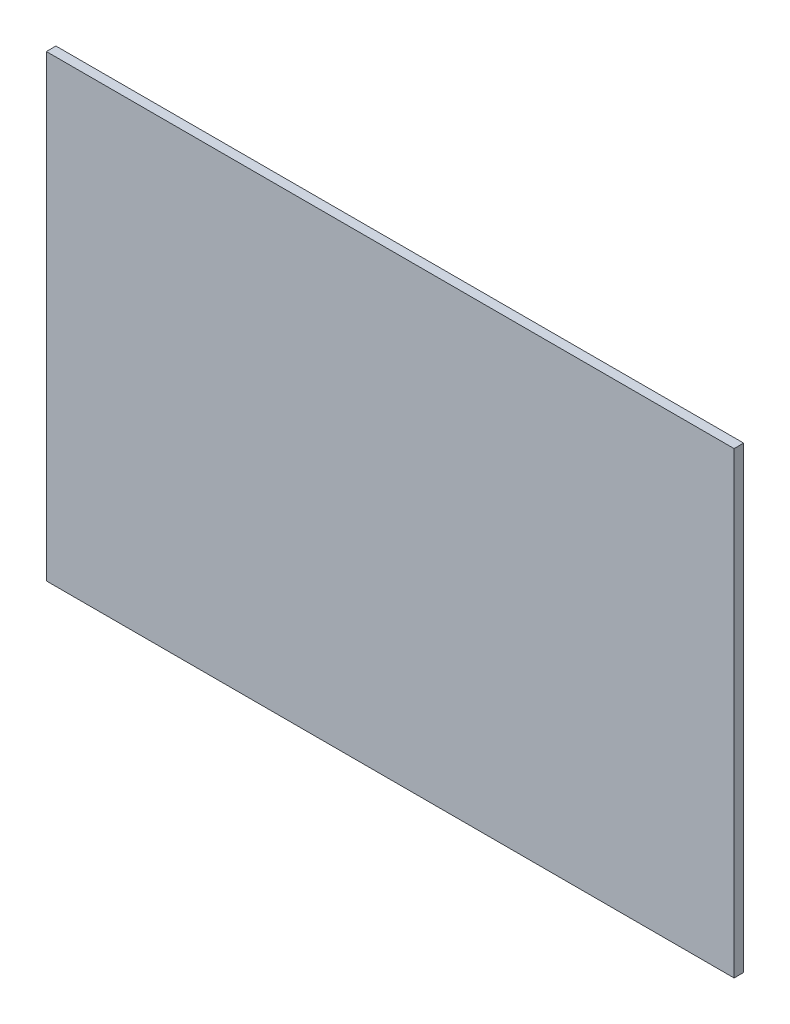
ISO-10303-21;
HEADER;
FILE_DESCRIPTION(('STEP AP214'),'2;1');
FILE_NAME('part.step','',(''),(''),'','','');
FILE_SCHEMA(('AUTOMOTIVE_DESIGN { 1 0 10303 214 1 1 1 1 }'));
ENDSEC;
DATA;
#1=APPLICATION_CONTEXT('core data for automotive mechanical design processes');
#2=APPLICATION_PROTOCOL_DEFINITION('international standard','automotive_design',2000,#1);
#3=PRODUCT_CONTEXT('',#1,'mechanical');
#4=PRODUCT('Part','Part','',(#3));
#5=PRODUCT_RELATED_PRODUCT_CATEGORY('part','',(#4));
#6=PRODUCT_DEFINITION_FORMATION('','',#4);
#7=PRODUCT_DEFINITION_CONTEXT('part definition',#1,'design');
#8=PRODUCT_DEFINITION('design','',#6,#7);
#9=PRODUCT_DEFINITION_SHAPE('','',#8);
#10=(LENGTH_UNIT() NAMED_UNIT(*) SI_UNIT(.MILLI.,.METRE.));
#11=(NAMED_UNIT(*) PLANE_ANGLE_UNIT() SI_UNIT($,.RADIAN.));
#12=(NAMED_UNIT(*) SI_UNIT($,.STERADIAN.) SOLID_ANGLE_UNIT());
#13=UNCERTAINTY_MEASURE_WITH_UNIT(LENGTH_MEASURE(1.E-05),#10,'distance_accuracy_value','');
#14=(GEOMETRIC_REPRESENTATION_CONTEXT(3) GLOBAL_UNCERTAINTY_ASSIGNED_CONTEXT((#13)) GLOBAL_UNIT_ASSIGNED_CONTEXT((#10,
#11,#12)) REPRESENTATION_CONTEXT('',''));
#15=CARTESIAN_POINT('',(0.,0.,0.));
#16=DIRECTION('',(0.,0.,1.));
#17=DIRECTION('',(1.,0.,0.));
#18=AXIS2_PLACEMENT_3D('',#15,#16,#17);
#19=CARTESIAN_POINT('',(-104.716119828816,1145.43673323823,25.4));
#20=DIRECTION('',(1.,0.,0.));
#21=DIRECTION('',(0.,1.,0.));
#22=AXIS2_PLACEMENT_3D('',#19,#20,#21);
#23=PLANE('',#22);
#24=DIRECTION('',(0.,-1.,0.));
#25=VECTOR('',#24,1.);
#26=CARTESIAN_POINT('',(-104.716119828816,1145.43673323823,0.));
#27=LINE('',#26,#25);
#28=CARTESIAN_POINT('',(-104.716119828816,1145.43673323823,0.));
#29=VERTEX_POINT('',#28);
#30=CARTESIAN_POINT('',(-104.716119828816,-73.7632667617689,0.));
#31=VERTEX_POINT('',#30);
#32=EDGE_CURVE('E94',#29,#31,#27,.T.);
#33=ORIENTED_EDGE('',*,*,#32,.T.);
#34=DIRECTION('',(0.,0.,-1.));
#35=VECTOR('',#34,1.);
#36=CARTESIAN_POINT('',(-104.716119828816,-73.7632667617689,25.4));
#37=LINE('',#36,#35);
#38=CARTESIAN_POINT('',(-104.716119828816,-73.7632667617689,25.4));
#39=VERTEX_POINT('',#38);
#40=EDGE_CURVE('E11',#39,#31,#37,.T.);
#41=ORIENTED_EDGE('',*,*,#40,.F.);
#42=DIRECTION('',(0.,-1.,0.));
#43=VECTOR('',#42,1.);
#44=CARTESIAN_POINT('',(-104.716119828816,1145.43673323823,25.4));
#45=LINE('',#44,#43);
#46=CARTESIAN_POINT('',(-104.716119828816,1145.43673323823,25.4));
#47=VERTEX_POINT('',#46);
#48=EDGE_CURVE('E82',#47,#39,#45,.T.);
#49=ORIENTED_EDGE('',*,*,#48,.F.);
#50=DIRECTION('',(0.,0.,-1.));
#51=VECTOR('',#50,1.);
#52=CARTESIAN_POINT('',(-104.716119828816,1145.43673323823,25.4));
#53=LINE('',#52,#51);
#54=EDGE_CURVE('E90',#47,#29,#53,.T.);
#55=ORIENTED_EDGE('',*,*,#54,.T.);
#56=EDGE_LOOP('',(#33,#41,#49,#55));
#57=FACE_BOUND('',#56,.T.);
#58=ADVANCED_FACE('F31',(#57),#23,.F.);
#59=CARTESIAN_POINT('',(-104.716119828816,-73.7632667617689,25.4));
#60=DIRECTION('',(0.,1.,0.));
#61=DIRECTION('',(0.,0.,1.));
#62=AXIS2_PLACEMENT_3D('',#59,#60,#61);
#63=PLANE('',#62);
#64=DIRECTION('',(1.,0.,0.));
#65=VECTOR('',#64,1.);
#66=CARTESIAN_POINT('',(-104.716119828816,-73.7632667617689,0.));
#67=LINE('',#66,#65);
#68=CARTESIAN_POINT('',(1724.08388017118,-73.7632667617689,0.));
#69=VERTEX_POINT('',#68);
#70=EDGE_CURVE('E86',#31,#69,#67,.T.);
#71=ORIENTED_EDGE('',*,*,#70,.T.);
#72=DIRECTION('',(0.,0.,-1.));
#73=VECTOR('',#72,1.);
#74=CARTESIAN_POINT('',(1724.08388017118,-73.7632667617689,25.4));
#75=LINE('',#74,#73);
#76=CARTESIAN_POINT('',(1724.08388017118,-73.7632667617689,25.4));
#77=VERTEX_POINT('',#76);
#78=EDGE_CURVE('E39',#77,#69,#75,.T.);
#79=ORIENTED_EDGE('',*,*,#78,.F.);
#80=DIRECTION('',(1.,0.,0.));
#81=VECTOR('',#80,1.);
#82=CARTESIAN_POINT('',(-104.716119828816,-73.7632667617689,25.4));
#83=LINE('',#82,#81);
#84=EDGE_CURVE('E77',#39,#77,#83,.T.);
#85=ORIENTED_EDGE('',*,*,#84,.F.);
#86=ORIENTED_EDGE('',*,*,#40,.T.);
#87=EDGE_LOOP('',(#71,#79,#85,#86));
#88=FACE_BOUND('',#87,.T.);
#89=ADVANCED_FACE('F85',(#88),#63,.F.);
#90=CARTESIAN_POINT('',(1724.08388017118,1145.43673323823,25.4));
#91=DIRECTION('',(-1.,0.,0.));
#92=DIRECTION('',(0.,-1.,0.));
#93=AXIS2_PLACEMENT_3D('',#90,#91,#92);
#94=PLANE('',#93);
#95=DIRECTION('',(0.,1.,0.));
#96=VECTOR('',#95,1.);
#97=CARTESIAN_POINT('',(1724.08388017118,1145.43673323823,0.));
#98=LINE('',#97,#96);
#99=CARTESIAN_POINT('',(1724.08388017118,1145.43673323823,0.));
#100=VERTEX_POINT('',#99);
#101=EDGE_CURVE('E64',#69,#100,#98,.T.);
#102=ORIENTED_EDGE('',*,*,#101,.T.);
#103=DIRECTION('',(0.,0.,-1.));
#104=VECTOR('',#103,1.);
#105=CARTESIAN_POINT('',(1724.08388017118,1145.43673323823,25.4));
#106=LINE('',#105,#104);
#107=CARTESIAN_POINT('',(1724.08388017118,1145.43673323823,25.4));
#108=VERTEX_POINT('',#107);
#109=EDGE_CURVE('E87',#108,#100,#106,.T.);
#110=ORIENTED_EDGE('',*,*,#109,.F.);
#111=DIRECTION('',(0.,1.,0.));
#112=VECTOR('',#111,1.);
#113=CARTESIAN_POINT('',(1724.08388017118,1145.43673323823,25.4));
#114=LINE('',#113,#112);
#115=EDGE_CURVE('E80',#77,#108,#114,.T.);
#116=ORIENTED_EDGE('',*,*,#115,.F.);
#117=ORIENTED_EDGE('',*,*,#78,.T.);
#118=EDGE_LOOP('',(#102,#110,#116,#117));
#119=FACE_BOUND('',#118,.T.);
#120=ADVANCED_FACE('F88',(#119),#94,.F.);
#121=CARTESIAN_POINT('',(-104.716119828816,1145.43673323823,25.4));
#122=DIRECTION('',(0.,-1.,0.));
#123=DIRECTION('',(0.,0.,-1.));
#124=AXIS2_PLACEMENT_3D('',#121,#122,#123);
#125=PLANE('',#124);
#126=DIRECTION('',(-1.,0.,0.));
#127=VECTOR('',#126,1.);
#128=CARTESIAN_POINT('',(-104.716119828816,1145.43673323823,0.));
#129=LINE('',#128,#127);
#130=EDGE_CURVE('E70',#100,#29,#129,.T.);
#131=ORIENTED_EDGE('',*,*,#130,.T.);
#132=ORIENTED_EDGE('',*,*,#54,.F.);
#133=DIRECTION('',(-1.,0.,0.));
#134=VECTOR('',#133,1.);
#135=CARTESIAN_POINT('',(-104.716119828816,1145.43673323823,25.4));
#136=LINE('',#135,#134);
#137=EDGE_CURVE('E47',#108,#47,#136,.T.);
#138=ORIENTED_EDGE('',*,*,#137,.F.);
#139=ORIENTED_EDGE('',*,*,#109,.T.);
#140=EDGE_LOOP('',(#131,#132,#138,#139));
#141=FACE_BOUND('',#140,.T.);
#142=ADVANCED_FACE('F101',(#141),#125,.F.);
#143=CARTESIAN_POINT('',(-104.716119828816,-73.7632667617689,25.4));
#144=DIRECTION('',(0.,0.,1.));
#145=DIRECTION('',(1.,0.,0.));
#146=AXIS2_PLACEMENT_3D('',#143,#144,#145);
#147=PLANE('',#146);
#148=ORIENTED_EDGE('',*,*,#48,.T.);
#149=ORIENTED_EDGE('',*,*,#84,.T.);
#150=ORIENTED_EDGE('',*,*,#115,.T.);
#151=ORIENTED_EDGE('',*,*,#137,.T.);
#152=EDGE_LOOP('',(#148,#149,#150,#151));
#153=FACE_BOUND('',#152,.T.);
#154=ADVANCED_FACE('F78',(#153),#147,.T.);
#155=CARTESIAN_POINT('',(-104.716119828816,-73.7632667617689,0.));
#156=DIRECTION('',(0.,0.,1.));
#157=DIRECTION('',(1.,0.,0.));
#158=AXIS2_PLACEMENT_3D('',#155,#156,#157);
#159=PLANE('',#158);
#160=ORIENTED_EDGE('',*,*,#32,.F.);
#161=ORIENTED_EDGE('',*,*,#130,.F.);
#162=ORIENTED_EDGE('',*,*,#101,.F.);
#163=ORIENTED_EDGE('',*,*,#70,.F.);
#164=EDGE_LOOP('',(#160,#161,#162,#163));
#165=FACE_BOUND('',#164,.T.);
#166=ADVANCED_FACE('F104',(#165),#159,.F.);
#167=CLOSED_SHELL('',(#58,#89,#120,#142,#154,#166));
#168=MANIFOLD_SOLID_BREP('B2',#167);
#169=ADVANCED_BREP_SHAPE_REPRESENTATION('',(#18,#168),#14);
#170=SHAPE_DEFINITION_REPRESENTATION(#9,#169);
ENDSEC;
END-ISO-10303-21;
